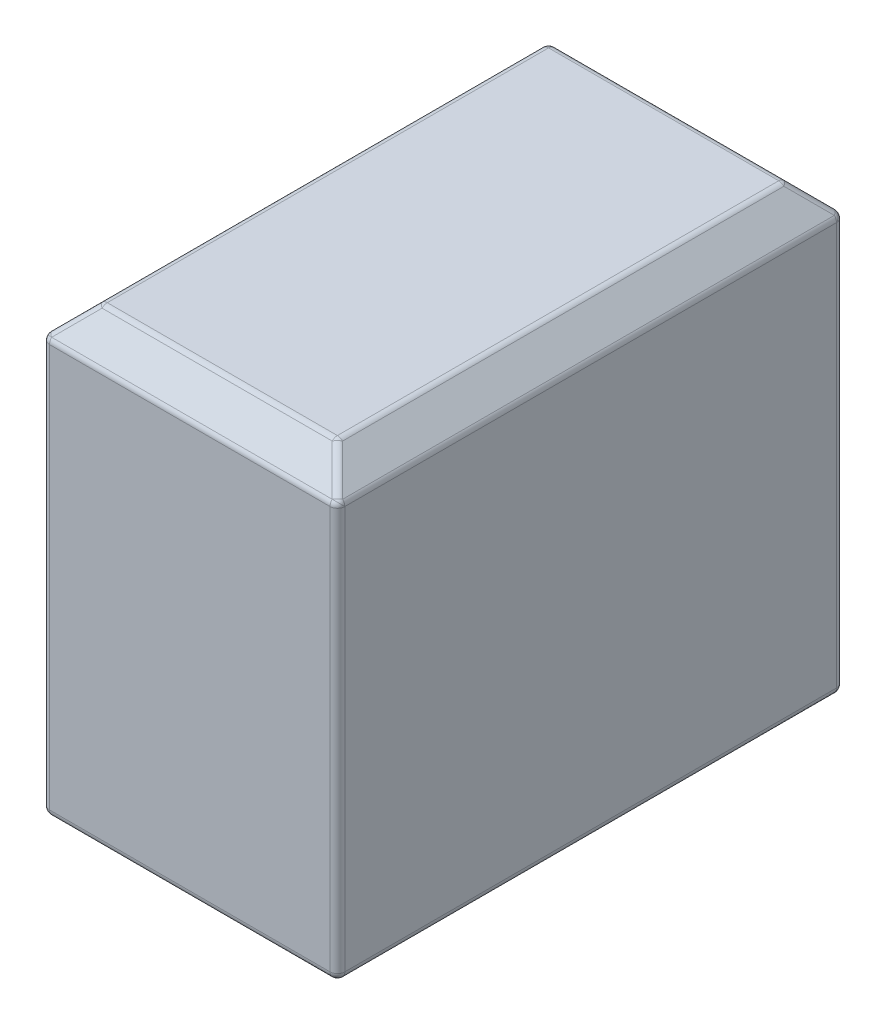
ISO-10303-21;
HEADER;
FILE_DESCRIPTION(('STEP AP214'),'2;1');
FILE_NAME('part.step','',(''),(''),'','','');
FILE_SCHEMA(('AUTOMOTIVE_DESIGN { 1 0 10303 214 1 1 1 1 }'));
ENDSEC;
DATA;
#1=APPLICATION_CONTEXT('core data for automotive mechanical design processes');
#2=APPLICATION_PROTOCOL_DEFINITION('international standard','automotive_design',2000,#1);
#3=PRODUCT_CONTEXT('',#1,'mechanical');
#4=PRODUCT('Part','Part','',(#3));
#5=PRODUCT_RELATED_PRODUCT_CATEGORY('part','',(#4));
#6=PRODUCT_DEFINITION_FORMATION('','',#4);
#7=PRODUCT_DEFINITION_CONTEXT('part definition',#1,'design');
#8=PRODUCT_DEFINITION('design','',#6,#7);
#9=PRODUCT_DEFINITION_SHAPE('','',#8);
#10=(LENGTH_UNIT() NAMED_UNIT(*) SI_UNIT(.MILLI.,.METRE.));
#11=(NAMED_UNIT(*) PLANE_ANGLE_UNIT() SI_UNIT($,.RADIAN.));
#12=(NAMED_UNIT(*) SI_UNIT($,.STERADIAN.) SOLID_ANGLE_UNIT());
#13=UNCERTAINTY_MEASURE_WITH_UNIT(LENGTH_MEASURE(1.E-05),#10,'distance_accuracy_value','');
#14=(GEOMETRIC_REPRESENTATION_CONTEXT(3) GLOBAL_UNCERTAINTY_ASSIGNED_CONTEXT((#13)) GLOBAL_UNIT_ASSIGNED_CONTEXT((#10,
#11,#12)) REPRESENTATION_CONTEXT('',''));
#15=CARTESIAN_POINT('',(0.,0.,0.));
#16=DIRECTION('',(0.,0.,1.));
#17=DIRECTION('',(1.,0.,0.));
#18=AXIS2_PLACEMENT_3D('',#15,#16,#17);
#19=CARTESIAN_POINT('',(1.,1.5,-1.715));
#20=DIRECTION('',(-1.,0.,0.));
#21=DIRECTION('',(0.,0.,1.));
#22=AXIS2_PLACEMENT_3D('',#19,#20,#21);
#23=PLANE('',#22);
#24=DIRECTION('',(0.,-1.,0.));
#25=VECTOR('',#24,1.);
#26=CARTESIAN_POINT('',(1.,1.5,1.665));
#27=LINE('',#26,#25);
#28=CARTESIAN_POINT('',(1.,1.27928932188134,1.665));
#29=VERTEX_POINT('',#28);
#30=CARTESIAN_POINT('',(1.,-1.45,1.665));
#31=VERTEX_POINT('',#30);
#32=EDGE_CURVE('E236',#29,#31,#27,.T.);
#33=ORIENTED_EDGE('',*,*,#32,.T.);
#34=DIRECTION('',(0.,0.,-1.));
#35=VECTOR('',#34,1.);
#36=CARTESIAN_POINT('',(1.,-1.45,-1.715));
#37=LINE('',#36,#35);
#38=CARTESIAN_POINT('',(1.,-1.45,-1.665));
#39=VERTEX_POINT('',#38);
#40=EDGE_CURVE('E239',#31,#39,#37,.T.);
#41=ORIENTED_EDGE('',*,*,#40,.T.);
#42=DIRECTION('',(0.,-1.,0.));
#43=VECTOR('',#42,1.);
#44=CARTESIAN_POINT('',(1.,1.5,-1.665));
#45=LINE('',#44,#43);
#46=CARTESIAN_POINT('',(1.,1.27928932188134,-1.665));
#47=VERTEX_POINT('',#46);
#48=EDGE_CURVE('E230',#39,#47,#45,.F.);
#49=ORIENTED_EDGE('',*,*,#48,.T.);
#50=DIRECTION('',(0.,0.,1.));
#51=VECTOR('',#50,1.);
#52=CARTESIAN_POINT('',(1.,1.27928932188134,1.715));
#53=LINE('',#52,#51);
#54=EDGE_CURVE('E233',#47,#29,#53,.T.);
#55=ORIENTED_EDGE('',*,*,#54,.T.);
#56=EDGE_LOOP('',(#33,#41,#49,#55));
#57=FACE_BOUND('',#56,.T.);
#58=ADVANCED_FACE('F39',(#57),#23,.F.);
#59=CARTESIAN_POINT('',(-1.,1.5,-1.715));
#60=DIRECTION('',(0.,0.,1.));
#61=DIRECTION('',(1.,0.,0.));
#62=AXIS2_PLACEMENT_3D('',#59,#60,#61);
#63=PLANE('',#62);
#64=DIRECTION('',(0.,-1.,0.));
#65=VECTOR('',#64,1.);
#66=CARTESIAN_POINT('',(0.95,1.5,-1.715));
#67=LINE('',#66,#65);
#68=CARTESIAN_POINT('',(0.95,1.27928932188134,-1.715));
#69=VERTEX_POINT('',#68);
#70=CARTESIAN_POINT('',(0.95,-1.45,-1.715));
#71=VERTEX_POINT('',#70);
#72=EDGE_CURVE('E250',#69,#71,#67,.T.);
#73=ORIENTED_EDGE('',*,*,#72,.T.);
#74=DIRECTION('',(-1.,0.,0.));
#75=VECTOR('',#74,1.);
#76=CARTESIAN_POINT('',(-1.,-1.45,-1.715));
#77=LINE('',#76,#75);
#78=CARTESIAN_POINT('',(-0.95,-1.45,-1.715));
#79=VERTEX_POINT('',#78);
#80=EDGE_CURVE('E284',#71,#79,#77,.T.);
#81=ORIENTED_EDGE('',*,*,#80,.T.);
#82=DIRECTION('',(0.,-1.,0.));
#83=VECTOR('',#82,1.);
#84=CARTESIAN_POINT('',(-0.95,1.5,-1.715));
#85=LINE('',#84,#83);
#86=CARTESIAN_POINT('',(-0.95,1.27928932188134,-1.715));
#87=VERTEX_POINT('',#86);
#88=EDGE_CURVE('E218',#79,#87,#85,.F.);
#89=ORIENTED_EDGE('',*,*,#88,.T.);
#90=DIRECTION('',(1.,0.,0.));
#91=VECTOR('',#90,1.);
#92=CARTESIAN_POINT('',(0.95,1.27928932188134,-1.715));
#93=LINE('',#92,#91);
#94=EDGE_CURVE('E282',#87,#69,#93,.T.);
#95=ORIENTED_EDGE('',*,*,#94,.T.);
#96=EDGE_LOOP('',(#73,#81,#89,#95));
#97=FACE_BOUND('',#96,.T.);
#98=ADVANCED_FACE('F500',(#97),#63,.F.);
#99=CARTESIAN_POINT('',(-1.,1.5,-1.715));
#100=DIRECTION('',(1.,0.,0.));
#101=DIRECTION('',(0.,0.,-1.));
#102=AXIS2_PLACEMENT_3D('',#99,#100,#101);
#103=PLANE('',#102);
#104=DIRECTION('',(0.,-1.,0.));
#105=VECTOR('',#104,1.);
#106=CARTESIAN_POINT('',(-1.,1.5,-1.665));
#107=LINE('',#106,#105);
#108=CARTESIAN_POINT('',(-1.,1.27928932188134,-1.665));
#109=VERTEX_POINT('',#108);
#110=CARTESIAN_POINT('',(-1.,-1.45,-1.665));
#111=VERTEX_POINT('',#110);
#112=EDGE_CURVE('E216',#109,#111,#107,.T.);
#113=ORIENTED_EDGE('',*,*,#112,.T.);
#114=DIRECTION('',(0.,0.,1.));
#115=VECTOR('',#114,1.);
#116=CARTESIAN_POINT('',(-1.,-1.45,-1.715));
#117=LINE('',#116,#115);
#118=CARTESIAN_POINT('',(-1.,-1.45,1.665));
#119=VERTEX_POINT('',#118);
#120=EDGE_CURVE('E197',#111,#119,#117,.T.);
#121=ORIENTED_EDGE('',*,*,#120,.T.);
#122=DIRECTION('',(0.,-1.,0.));
#123=VECTOR('',#122,1.);
#124=CARTESIAN_POINT('',(-1.,1.5,1.665));
#125=LINE('',#124,#123);
#126=CARTESIAN_POINT('',(-1.,1.27928932188134,1.665));
#127=VERTEX_POINT('',#126);
#128=EDGE_CURVE('E204',#119,#127,#125,.F.);
#129=ORIENTED_EDGE('',*,*,#128,.T.);
#130=DIRECTION('',(0.,0.,-1.));
#131=VECTOR('',#130,1.);
#132=CARTESIAN_POINT('',(-1.,1.27928932188134,-1.715));
#133=LINE('',#132,#131);
#134=EDGE_CURVE('E210',#127,#109,#133,.T.);
#135=ORIENTED_EDGE('',*,*,#134,.T.);
#136=EDGE_LOOP('',(#113,#121,#129,#135));
#137=FACE_BOUND('',#136,.T.);
#138=ADVANCED_FACE('F214',(#137),#103,.F.);
#139=CARTESIAN_POINT('',(-1.,1.5,1.715));
#140=DIRECTION('',(0.,0.,-1.));
#141=DIRECTION('',(-1.,0.,0.));
#142=AXIS2_PLACEMENT_3D('',#139,#140,#141);
#143=PLANE('',#142);
#144=DIRECTION('',(0.,-1.,0.));
#145=VECTOR('',#144,1.);
#146=CARTESIAN_POINT('',(0.95,1.5,1.715));
#147=LINE('',#146,#145);
#148=CARTESIAN_POINT('',(0.95,-1.45,1.715));
#149=VERTEX_POINT('',#148);
#150=CARTESIAN_POINT('',(0.95,1.27928932188134,1.715));
#151=VERTEX_POINT('',#150);
#152=EDGE_CURVE('E245',#149,#151,#147,.F.);
#153=ORIENTED_EDGE('',*,*,#152,.T.);
#154=DIRECTION('',(-1.,0.,0.));
#155=VECTOR('',#154,1.);
#156=CARTESIAN_POINT('',(-0.95,1.27928932188134,1.715));
#157=LINE('',#156,#155);
#158=CARTESIAN_POINT('',(-0.95,1.27928932188134,1.715));
#159=VERTEX_POINT('',#158);
#160=EDGE_CURVE('E334',#151,#159,#157,.T.);
#161=ORIENTED_EDGE('',*,*,#160,.T.);
#162=DIRECTION('',(0.,-1.,0.));
#163=VECTOR('',#162,1.);
#164=CARTESIAN_POINT('',(-0.95,1.5,1.715));
#165=LINE('',#164,#163);
#166=CARTESIAN_POINT('',(-0.95,-1.45,1.715));
#167=VERTEX_POINT('',#166);
#168=EDGE_CURVE('E228',#159,#167,#165,.T.);
#169=ORIENTED_EDGE('',*,*,#168,.T.);
#170=DIRECTION('',(1.,0.,0.));
#171=VECTOR('',#170,1.);
#172=CARTESIAN_POINT('',(-1.,-1.45,1.715));
#173=LINE('',#172,#171);
#174=EDGE_CURVE('E332',#167,#149,#173,.T.);
#175=ORIENTED_EDGE('',*,*,#174,.T.);
#176=EDGE_LOOP('',(#153,#161,#169,#175));
#177=FACE_BOUND('',#176,.T.);
#178=ADVANCED_FACE('F807',(#177),#143,.F.);
#179=CARTESIAN_POINT('',(0.,1.5,0.));
#180=DIRECTION('',(0.,1.,0.));
#181=DIRECTION('',(0.,0.,1.));
#182=AXIS2_PLACEMENT_3D('',#179,#180,#181);
#183=PLANE('',#182);
#184=DIRECTION('',(-1.,0.,0.));
#185=VECTOR('',#184,1.);
#186=CARTESIAN_POINT('',(0.,1.5,-1.49428932188135));
#187=LINE('',#186,#185);
#188=CARTESIAN_POINT('',(0.779289321881345,1.5,-1.49428932188135));
#189=VERTEX_POINT('',#188);
#190=CARTESIAN_POINT('',(-0.779289321881345,1.5,-1.49428932188135));
#191=VERTEX_POINT('',#190);
#192=EDGE_CURVE('E365',#189,#191,#187,.T.);
#193=ORIENTED_EDGE('',*,*,#192,.T.);
#194=DIRECTION('',(0.,0.,1.));
#195=VECTOR('',#194,1.);
#196=CARTESIAN_POINT('',(-0.779289321881345,1.5,0.));
#197=LINE('',#196,#195);
#198=CARTESIAN_POINT('',(-0.779289321881345,1.5,1.49428932188135));
#199=VERTEX_POINT('',#198);
#200=EDGE_CURVE('E367',#191,#199,#197,.T.);
#201=ORIENTED_EDGE('',*,*,#200,.T.);
#202=DIRECTION('',(1.,0.,0.));
#203=VECTOR('',#202,1.);
#204=CARTESIAN_POINT('',(0.,1.5,1.49428932188135));
#205=LINE('',#204,#203);
#206=CARTESIAN_POINT('',(0.779289321881345,1.5,1.49428932188135));
#207=VERTEX_POINT('',#206);
#208=EDGE_CURVE('E361',#199,#207,#205,.T.);
#209=ORIENTED_EDGE('',*,*,#208,.T.);
#210=DIRECTION('',(0.,0.,-1.));
#211=VECTOR('',#210,1.);
#212=CARTESIAN_POINT('',(0.779289321881345,1.5,0.));
#213=LINE('',#212,#211);
#214=EDGE_CURVE('E363',#207,#189,#213,.T.);
#215=ORIENTED_EDGE('',*,*,#214,.T.);
#216=EDGE_LOOP('',(#193,#201,#209,#215));
#217=FACE_BOUND('',#216,.T.);
#218=ADVANCED_FACE('F482',(#217),#183,.T.);
#219=CARTESIAN_POINT('',(0.,-1.5,0.));
#220=DIRECTION('',(0.,1.,0.));
#221=DIRECTION('',(0.,0.,1.));
#222=AXIS2_PLACEMENT_3D('',#219,#220,#221);
#223=PLANE('',#222);
#224=DIRECTION('',(0.,0.,-1.));
#225=VECTOR('',#224,1.);
#226=CARTESIAN_POINT('',(0.95,-1.5,0.));
#227=LINE('',#226,#225);
#228=CARTESIAN_POINT('',(0.95,-1.5,-1.665));
#229=VERTEX_POINT('',#228);
#230=CARTESIAN_POINT('',(0.95,-1.5,1.665));
#231=VERTEX_POINT('',#230);
#232=EDGE_CURVE('E242',#229,#231,#227,.F.);
#233=ORIENTED_EDGE('',*,*,#232,.T.);
#234=DIRECTION('',(1.,0.,0.));
#235=VECTOR('',#234,1.);
#236=CARTESIAN_POINT('',(0.,-1.5,1.665));
#237=LINE('',#236,#235);
#238=CARTESIAN_POINT('',(-0.95,-1.5,1.665));
#239=VERTEX_POINT('',#238);
#240=EDGE_CURVE('E336',#231,#239,#237,.F.);
#241=ORIENTED_EDGE('',*,*,#240,.T.);
#242=DIRECTION('',(0.,0.,1.));
#243=VECTOR('',#242,1.);
#244=CARTESIAN_POINT('',(-0.95,-1.5,0.));
#245=LINE('',#244,#243);
#246=CARTESIAN_POINT('',(-0.95,-1.5,-1.665));
#247=VERTEX_POINT('',#246);
#248=EDGE_CURVE('E199',#239,#247,#245,.F.);
#249=ORIENTED_EDGE('',*,*,#248,.T.);
#250=DIRECTION('',(-1.,0.,0.));
#251=VECTOR('',#250,1.);
#252=CARTESIAN_POINT('',(0.,-1.5,-1.665));
#253=LINE('',#252,#251);
#254=EDGE_CURVE('E286',#247,#229,#253,.F.);
#255=ORIENTED_EDGE('',*,*,#254,.T.);
#256=EDGE_LOOP('',(#233,#241,#249,#255));
#257=FACE_BOUND('',#256,.T.);
#258=ADVANCED_FACE('F520',(#257),#223,.F.);
#259=CARTESIAN_POINT('',(0.,1.5,-1.515));
#260=DIRECTION('',(0.,0.707106781186547,-0.707106781186548));
#261=DIRECTION('',(1.,0.,0.));
#262=AXIS2_PLACEMENT_3D('',#259,#260,#261);
#263=PLANE('',#262);
#264=DIRECTION('',(-0.577350269189626,-0.577350269189627,-0.577350269189625));
#265=VECTOR('',#264,1.);
#266=CARTESIAN_POINT('',(-0.509763107293782,1.75488155364689,-1.26011844635311));
#267=LINE('',#266,#265);
#268=CARTESIAN_POINT('',(-0.95,1.31464466094067,-1.70035533905933));
#269=VERTEX_POINT('',#268);
#270=CARTESIAN_POINT('',(-0.779289321881345,1.48535533905933,-1.52964466094067));
#271=VERTEX_POINT('',#270);
#272=EDGE_CURVE('E261',#269,#271,#267,.F.);
#273=ORIENTED_EDGE('',*,*,#272,.T.);
#274=DIRECTION('',(-1.,0.,0.));
#275=VECTOR('',#274,1.);
#276=CARTESIAN_POINT('',(0.,1.48535533905933,-1.52964466094067));
#277=LINE('',#276,#275);
#278=CARTESIAN_POINT('',(0.779289321881345,1.48535533905933,-1.52964466094067));
#279=VERTEX_POINT('',#278);
#280=EDGE_CURVE('E374',#271,#279,#277,.F.);
#281=ORIENTED_EDGE('',*,*,#280,.T.);
#282=DIRECTION('',(-0.577350269189625,0.577350269189627,0.577350269189625));
#283=VECTOR('',#282,1.);
#284=CARTESIAN_POINT('',(0.509763107293782,1.75488155364689,-1.26011844635311));
#285=LINE('',#284,#283);
#286=CARTESIAN_POINT('',(0.95,1.31464466094067,-1.70035533905933));
#287=VERTEX_POINT('',#286);
#288=EDGE_CURVE('E259',#279,#287,#285,.F.);
#289=ORIENTED_EDGE('',*,*,#288,.T.);
#290=DIRECTION('',(1.,0.,0.));
#291=VECTOR('',#290,1.);
#292=CARTESIAN_POINT('',(-0.95,1.31464466094067,-1.70035533905933));
#293=LINE('',#292,#291);
#294=EDGE_CURVE('E257',#287,#269,#293,.F.);
#295=ORIENTED_EDGE('',*,*,#294,.T.);
#296=EDGE_LOOP('',(#273,#281,#289,#295));
#297=FACE_BOUND('',#296,.T.);
#298=ADVANCED_FACE('F435',(#297),#263,.T.);
#299=CARTESIAN_POINT('',(-0.8,1.5,0.));
#300=DIRECTION('',(-0.707106781186548,0.707106781186547,0.));
#301=DIRECTION('',(0.,0.,-1.));
#302=AXIS2_PLACEMENT_3D('',#299,#300,#301);
#303=PLANE('',#302);
#304=DIRECTION('',(-0.577350269189625,-0.577350269189627,0.577350269189625));
#305=VECTOR('',#304,1.);
#306=CARTESIAN_POINT('',(-0.306785113019776,1.99321488698022,0.986429773960449));
#307=LINE('',#306,#305);
#308=CARTESIAN_POINT('',(-0.985355339059327,1.31464466094067,1.665));
#309=VERTEX_POINT('',#308);
#310=CARTESIAN_POINT('',(-0.814644660940672,1.48535533905933,1.49428932188135));
#311=VERTEX_POINT('',#310);
#312=EDGE_CURVE('E323',#309,#311,#307,.F.);
#313=ORIENTED_EDGE('',*,*,#312,.T.);
#314=DIRECTION('',(0.,0.,1.));
#315=VECTOR('',#314,1.);
#316=CARTESIAN_POINT('',(-0.814644660940672,1.48535533905933,0.));
#317=LINE('',#316,#315);
#318=CARTESIAN_POINT('',(-0.814644660940673,1.48535533905933,-1.49428932188135));
#319=VERTEX_POINT('',#318);
#320=EDGE_CURVE('E370',#311,#319,#317,.F.);
#321=ORIENTED_EDGE('',*,*,#320,.T.);
#322=DIRECTION('',(-0.577350269189625,-0.577350269189627,-0.577350269189625));
#323=VECTOR('',#322,1.);
#324=CARTESIAN_POINT('',(-0.306785113019776,1.99321488698022,-0.986429773960449));
#325=LINE('',#324,#323);
#326=CARTESIAN_POINT('',(-0.985355339059327,1.31464466094067,-1.665));
#327=VERTEX_POINT('',#326);
#328=EDGE_CURVE('E253',#319,#327,#325,.T.);
#329=ORIENTED_EDGE('',*,*,#328,.T.);
#330=DIRECTION('',(0.,0.,-1.));
#331=VECTOR('',#330,1.);
#332=CARTESIAN_POINT('',(-0.985355339059327,1.31464466094067,1.715));
#333=LINE('',#332,#331);
#334=EDGE_CURVE('E225',#327,#309,#333,.F.);
#335=ORIENTED_EDGE('',*,*,#334,.T.);
#336=EDGE_LOOP('',(#313,#321,#329,#335));
#337=FACE_BOUND('',#336,.T.);
#338=ADVANCED_FACE('F451',(#337),#303,.T.);
#339=CARTESIAN_POINT('',(0.8,1.5,0.));
#340=DIRECTION('',(0.707106781186548,0.707106781186547,0.));
#341=DIRECTION('',(0.,0.,1.));
#342=AXIS2_PLACEMENT_3D('',#339,#340,#341);
#343=PLANE('',#342);
#344=DIRECTION('',(-0.577350269189625,0.577350269189627,0.577350269189625));
#345=VECTOR('',#344,1.);
#346=CARTESIAN_POINT('',(0.306785113019777,1.99321488698022,-0.986429773960449));
#347=LINE('',#346,#345);
#348=CARTESIAN_POINT('',(0.985355339059327,1.31464466094067,-1.665));
#349=VERTEX_POINT('',#348);
#350=CARTESIAN_POINT('',(0.814644660940673,1.48535533905933,-1.49428932188135));
#351=VERTEX_POINT('',#350);
#352=EDGE_CURVE('E264',#349,#351,#347,.T.);
#353=ORIENTED_EDGE('',*,*,#352,.T.);
#354=DIRECTION('',(0.,0.,-1.));
#355=VECTOR('',#354,1.);
#356=CARTESIAN_POINT('',(0.814644660940673,1.48535533905933,0.));
#357=LINE('',#356,#355);
#358=CARTESIAN_POINT('',(0.814644660940673,1.48535533905933,1.49428932188135));
#359=VERTEX_POINT('',#358);
#360=EDGE_CURVE('E63',#351,#359,#357,.F.);
#361=ORIENTED_EDGE('',*,*,#360,.T.);
#362=DIRECTION('',(-0.577350269189625,0.577350269189627,-0.577350269189625));
#363=VECTOR('',#362,1.);
#364=CARTESIAN_POINT('',(0.306785113019777,1.99321488698022,0.986429773960449));
#365=LINE('',#364,#363);
#366=CARTESIAN_POINT('',(0.985355339059327,1.31464466094067,1.665));
#367=VERTEX_POINT('',#366);
#368=EDGE_CURVE('E318',#359,#367,#365,.F.);
#369=ORIENTED_EDGE('',*,*,#368,.T.);
#370=DIRECTION('',(0.,0.,1.));
#371=VECTOR('',#370,1.);
#372=CARTESIAN_POINT('',(0.985355339059327,1.31464466094067,-1.715));
#373=LINE('',#372,#371);
#374=EDGE_CURVE('E248',#367,#349,#373,.F.);
#375=ORIENTED_EDGE('',*,*,#374,.T.);
#376=EDGE_LOOP('',(#353,#361,#369,#375));
#377=FACE_BOUND('',#376,.T.);
#378=ADVANCED_FACE('F414',(#377),#343,.T.);
#379=CARTESIAN_POINT('',(0.,1.5,1.515));
#380=DIRECTION('',(0.,0.707106781186547,0.707106781186548));
#381=DIRECTION('',(-1.,0.,0.));
#382=AXIS2_PLACEMENT_3D('',#379,#380,#381);
#383=PLANE('',#382);
#384=DIRECTION('',(-0.577350269189625,0.577350269189627,-0.577350269189625));
#385=VECTOR('',#384,1.);
#386=CARTESIAN_POINT('',(0.509763107293782,1.75488155364689,1.26011844635311));
#387=LINE('',#386,#385);
#388=CARTESIAN_POINT('',(0.95,1.31464466094067,1.70035533905933));
#389=VERTEX_POINT('',#388);
#390=CARTESIAN_POINT('',(0.779289321881345,1.48535533905933,1.52964466094067));
#391=VERTEX_POINT('',#390);
#392=EDGE_CURVE('E316',#389,#391,#387,.T.);
#393=ORIENTED_EDGE('',*,*,#392,.T.);
#394=DIRECTION('',(1.,0.,0.));
#395=VECTOR('',#394,1.);
#396=CARTESIAN_POINT('',(0.,1.48535533905933,1.52964466094067));
#397=LINE('',#396,#395);
#398=CARTESIAN_POINT('',(-0.779289321881344,1.48535533905933,1.52964466094067));
#399=VERTEX_POINT('',#398);
#400=EDGE_CURVE('E11',#391,#399,#397,.F.);
#401=ORIENTED_EDGE('',*,*,#400,.T.);
#402=DIRECTION('',(-0.577350269189625,-0.577350269189627,0.577350269189625));
#403=VECTOR('',#402,1.);
#404=CARTESIAN_POINT('',(-0.509763107293782,1.75488155364689,1.26011844635311));
#405=LINE('',#404,#403);
#406=CARTESIAN_POINT('',(-0.95,1.31464466094067,1.70035533905933));
#407=VERTEX_POINT('',#406);
#408=EDGE_CURVE('E314',#399,#407,#405,.T.);
#409=ORIENTED_EDGE('',*,*,#408,.T.);
#410=DIRECTION('',(-1.,0.,0.));
#411=VECTOR('',#410,1.);
#412=CARTESIAN_POINT('',(0.95,1.31464466094067,1.70035533905933));
#413=LINE('',#412,#411);
#414=EDGE_CURVE('E288',#407,#389,#413,.F.);
#415=ORIENTED_EDGE('',*,*,#414,.T.);
#416=EDGE_LOOP('',(#393,#401,#409,#415));
#417=FACE_BOUND('',#416,.T.);
#418=ADVANCED_FACE('F469',(#417),#383,.T.);
#419=CARTESIAN_POINT('',(-0.95,1.27928932188134,-1.715));
#420=DIRECTION('',(0.,0.,1.));
#421=DIRECTION('',(1.,0.,0.));
#422=AXIS2_PLACEMENT_3D('',#419,#420,#421);
#423=CYLINDRICAL_SURFACE('',#422,0.05);
#424=ORIENTED_EDGE('',*,*,#134,.F.);
#425=CARTESIAN_POINT('',(-0.95,1.27928932188134,1.665));
#426=DIRECTION('',(0.,0.,1.));
#427=DIRECTION('',(1.,0.,0.));
#428=AXIS2_PLACEMENT_3D('',#425,#426,#427);
#429=CIRCLE('',#428,0.05);
#430=EDGE_CURVE('E201',#127,#309,#429,.F.);
#431=ORIENTED_EDGE('',*,*,#430,.T.);
#432=ORIENTED_EDGE('',*,*,#334,.F.);
#433=CARTESIAN_POINT('',(-0.95,1.27928932188134,-1.665));
#434=DIRECTION('',(0.,0.,1.));
#435=DIRECTION('',(1.,0.,0.));
#436=AXIS2_PLACEMENT_3D('',#433,#434,#435);
#437=CIRCLE('',#436,0.05);
#438=EDGE_CURVE('E255',#327,#109,#437,.T.);
#439=ORIENTED_EDGE('',*,*,#438,.T.);
#440=EDGE_LOOP('',(#424,#431,#432,#439));
#441=FACE_BOUND('',#440,.T.);
#442=ADVANCED_FACE('F447',(#441),#423,.T.);
#443=CARTESIAN_POINT('',(-0.95,1.5,-1.665));
#444=DIRECTION('',(0.,-1.,0.));
#445=DIRECTION('',(0.,0.,-1.));
#446=AXIS2_PLACEMENT_3D('',#443,#444,#445);
#447=CYLINDRICAL_SURFACE('',#446,0.05);
#448=ORIENTED_EDGE('',*,*,#88,.F.);
#449=CARTESIAN_POINT('',(-0.95,-1.45,-1.665));
#450=DIRECTION('',(0.,-1.,0.));
#451=DIRECTION('',(0.,0.,-1.));
#452=AXIS2_PLACEMENT_3D('',#449,#450,#451);
#453=CIRCLE('',#452,0.05);
#454=EDGE_CURVE('E277',#79,#111,#453,.F.);
#455=ORIENTED_EDGE('',*,*,#454,.T.);
#456=ORIENTED_EDGE('',*,*,#112,.F.);
#457=CARTESIAN_POINT('',(-0.95,1.27928932188134,-1.665));
#458=DIRECTION('',(0.,-1.,0.));
#459=DIRECTION('',(0.,0.,-1.));
#460=AXIS2_PLACEMENT_3D('',#457,#458,#459);
#461=CIRCLE('',#460,0.05);
#462=EDGE_CURVE('E275',#109,#87,#461,.T.);
#463=ORIENTED_EDGE('',*,*,#462,.T.);
#464=EDGE_LOOP('',(#448,#455,#456,#463));
#465=FACE_BOUND('',#464,.T.);
#466=ADVANCED_FACE('F525',(#465),#447,.T.);
#467=CARTESIAN_POINT('',(-0.95,1.5,1.665));
#468=DIRECTION('',(0.,-1.,0.));
#469=DIRECTION('',(0.,0.,-1.));
#470=AXIS2_PLACEMENT_3D('',#467,#468,#469);
#471=CYLINDRICAL_SURFACE('',#470,0.05);
#472=ORIENTED_EDGE('',*,*,#168,.F.);
#473=CARTESIAN_POINT('',(-0.95,1.27928932188134,1.665));
#474=DIRECTION('',(0.,-1.,0.));
#475=DIRECTION('',(0.,0.,-1.));
#476=AXIS2_PLACEMENT_3D('',#473,#474,#475);
#477=CIRCLE('',#476,0.05);
#478=EDGE_CURVE('E188',#159,#127,#477,.T.);
#479=ORIENTED_EDGE('',*,*,#478,.T.);
#480=ORIENTED_EDGE('',*,*,#128,.F.);
#481=CARTESIAN_POINT('',(-0.95,-1.45,1.665));
#482=DIRECTION('',(0.,-1.,0.));
#483=DIRECTION('',(0.,0.,-1.));
#484=AXIS2_PLACEMENT_3D('',#481,#482,#483);
#485=CIRCLE('',#484,0.05);
#486=EDGE_CURVE('E178',#119,#167,#485,.F.);
#487=ORIENTED_EDGE('',*,*,#486,.T.);
#488=EDGE_LOOP('',(#472,#479,#480,#487));
#489=FACE_BOUND('',#488,.T.);
#490=ADVANCED_FACE('F205',(#489),#471,.T.);
#491=CARTESIAN_POINT('',(-0.95,-1.45,-1.715));
#492=DIRECTION('',(0.,0.,1.));
#493=DIRECTION('',(1.,0.,0.));
#494=AXIS2_PLACEMENT_3D('',#491,#492,#493);
#495=CYLINDRICAL_SURFACE('',#494,0.05);
#496=ORIENTED_EDGE('',*,*,#248,.F.);
#497=CARTESIAN_POINT('',(-0.95,-1.45,1.665));
#498=DIRECTION('',(0.,0.,1.));
#499=DIRECTION('',(1.,0.,0.));
#500=AXIS2_PLACEMENT_3D('',#497,#498,#499);
#501=CIRCLE('',#500,0.05);
#502=EDGE_CURVE('E181',#239,#119,#501,.F.);
#503=ORIENTED_EDGE('',*,*,#502,.T.);
#504=ORIENTED_EDGE('',*,*,#120,.F.);
#505=CARTESIAN_POINT('',(-0.95,-1.45,-1.665));
#506=DIRECTION('',(0.,0.,1.));
#507=DIRECTION('',(1.,0.,0.));
#508=AXIS2_PLACEMENT_3D('',#505,#506,#507);
#509=CIRCLE('',#508,0.05);
#510=EDGE_CURVE('E273',#111,#247,#509,.T.);
#511=ORIENTED_EDGE('',*,*,#510,.T.);
#512=EDGE_LOOP('',(#496,#503,#504,#511));
#513=FACE_BOUND('',#512,.T.);
#514=ADVANCED_FACE('F194',(#513),#495,.T.);
#515=CARTESIAN_POINT('',(0.95,1.27928932188134,-1.715));
#516=DIRECTION('',(0.,0.,-1.));
#517=DIRECTION('',(-1.,0.,0.));
#518=AXIS2_PLACEMENT_3D('',#515,#516,#517);
#519=CYLINDRICAL_SURFACE('',#518,0.05);
#520=ORIENTED_EDGE('',*,*,#374,.F.);
#521=CARTESIAN_POINT('',(0.95,1.27928932188134,1.665));
#522=DIRECTION('',(0.,0.,-1.));
#523=DIRECTION('',(-1.,0.,0.));
#524=AXIS2_PLACEMENT_3D('',#521,#522,#523);
#525=CIRCLE('',#524,0.05);
#526=EDGE_CURVE('E320',#367,#29,#525,.T.);
#527=ORIENTED_EDGE('',*,*,#526,.T.);
#528=ORIENTED_EDGE('',*,*,#54,.F.);
#529=CARTESIAN_POINT('',(0.95,1.27928932188134,-1.665));
#530=DIRECTION('',(0.,0.,-1.));
#531=DIRECTION('',(-1.,0.,0.));
#532=AXIS2_PLACEMENT_3D('',#529,#530,#531);
#533=CIRCLE('',#532,0.05);
#534=EDGE_CURVE('E279',#47,#349,#533,.F.);
#535=ORIENTED_EDGE('',*,*,#534,.T.);
#536=EDGE_LOOP('',(#520,#527,#528,#535));
#537=FACE_BOUND('',#536,.T.);
#538=ADVANCED_FACE('F420',(#537),#519,.T.);
#539=CARTESIAN_POINT('',(0.95,1.5,1.665));
#540=DIRECTION('',(0.,-1.,0.));
#541=DIRECTION('',(0.,0.,-1.));
#542=AXIS2_PLACEMENT_3D('',#539,#540,#541);
#543=CYLINDRICAL_SURFACE('',#542,0.05);
#544=ORIENTED_EDGE('',*,*,#32,.F.);
#545=CARTESIAN_POINT('',(0.95,1.27928932188134,1.665));
#546=DIRECTION('',(0.,-1.,0.));
#547=DIRECTION('',(0.,0.,-1.));
#548=AXIS2_PLACEMENT_3D('',#545,#546,#547);
#549=CIRCLE('',#548,0.05);
#550=EDGE_CURVE('E189',#29,#151,#549,.T.);
#551=ORIENTED_EDGE('',*,*,#550,.T.);
#552=ORIENTED_EDGE('',*,*,#152,.F.);
#553=CARTESIAN_POINT('',(0.95,-1.45,1.665));
#554=DIRECTION('',(0.,-1.,0.));
#555=DIRECTION('',(0.,0.,-1.));
#556=AXIS2_PLACEMENT_3D('',#553,#554,#555);
#557=CIRCLE('',#556,0.05);
#558=EDGE_CURVE('E326',#149,#31,#557,.F.);
#559=ORIENTED_EDGE('',*,*,#558,.T.);
#560=EDGE_LOOP('',(#544,#551,#552,#559));
#561=FACE_BOUND('',#560,.T.);
#562=ADVANCED_FACE('F538',(#561),#543,.T.);
#563=CARTESIAN_POINT('',(0.95,1.5,-1.665));
#564=DIRECTION('',(0.,-1.,0.));
#565=DIRECTION('',(0.,0.,-1.));
#566=AXIS2_PLACEMENT_3D('',#563,#564,#565);
#567=CYLINDRICAL_SURFACE('',#566,0.05);
#568=ORIENTED_EDGE('',*,*,#48,.F.);
#569=CARTESIAN_POINT('',(0.95,-1.45,-1.665));
#570=DIRECTION('',(0.,-1.,0.));
#571=DIRECTION('',(0.,0.,-1.));
#572=AXIS2_PLACEMENT_3D('',#569,#570,#571);
#573=CIRCLE('',#572,0.05);
#574=EDGE_CURVE('E271',#39,#71,#573,.F.);
#575=ORIENTED_EDGE('',*,*,#574,.T.);
#576=ORIENTED_EDGE('',*,*,#72,.F.);
#577=CARTESIAN_POINT('',(0.95,1.27928932188134,-1.665));
#578=DIRECTION('',(0.,-1.,0.));
#579=DIRECTION('',(0.,0.,-1.));
#580=AXIS2_PLACEMENT_3D('',#577,#578,#579);
#581=CIRCLE('',#580,0.05);
#582=EDGE_CURVE('E269',#69,#47,#581,.T.);
#583=ORIENTED_EDGE('',*,*,#582,.T.);
#584=EDGE_LOOP('',(#568,#575,#576,#583));
#585=FACE_BOUND('',#584,.T.);
#586=ADVANCED_FACE('F534',(#585),#567,.T.);
#587=CARTESIAN_POINT('',(0.95,-1.45,-1.715));
#588=DIRECTION('',(0.,0.,-1.));
#589=DIRECTION('',(-1.,0.,0.));
#590=AXIS2_PLACEMENT_3D('',#587,#588,#589);
#591=CYLINDRICAL_SURFACE('',#590,0.05);
#592=ORIENTED_EDGE('',*,*,#40,.F.);
#593=CARTESIAN_POINT('',(0.95,-1.45,1.665));
#594=DIRECTION('',(0.,0.,-1.));
#595=DIRECTION('',(-1.,0.,0.));
#596=AXIS2_PLACEMENT_3D('',#593,#594,#595);
#597=CIRCLE('',#596,0.05);
#598=EDGE_CURVE('E200',#31,#231,#597,.T.);
#599=ORIENTED_EDGE('',*,*,#598,.T.);
#600=ORIENTED_EDGE('',*,*,#232,.F.);
#601=CARTESIAN_POINT('',(0.95,-1.45,-1.665));
#602=DIRECTION('',(0.,0.,-1.));
#603=DIRECTION('',(-1.,0.,0.));
#604=AXIS2_PLACEMENT_3D('',#601,#602,#603);
#605=CIRCLE('',#604,0.05);
#606=EDGE_CURVE('E266',#229,#39,#605,.F.);
#607=ORIENTED_EDGE('',*,*,#606,.T.);
#608=EDGE_LOOP('',(#592,#599,#600,#607));
#609=FACE_BOUND('',#608,.T.);
#610=ADVANCED_FACE('F531',(#609),#591,.T.);
#611=CARTESIAN_POINT('',(0.271429773960449,1.9578595479209,-0.986429773960449));
#612=DIRECTION('',(-0.577350269189625,0.577350269189627,0.577350269189625));
#613=DIRECTION('',(0.,-0.707106781186547,0.707106781186548));
#614=AXIS2_PLACEMENT_3D('',#611,#612,#613);
#615=CYLINDRICAL_SURFACE('',#614,0.05);
#616=ORIENTED_EDGE('',*,*,#288,.F.);
#617=CARTESIAN_POINT('',(0.779289321881345,1.45,-1.49428932188135));
#618=DIRECTION('',(-0.577350269189625,0.577350269189627,0.577350269189625));
#619=DIRECTION('',(0.,-0.707106781186547,0.707106781186548));
#620=AXIS2_PLACEMENT_3D('',#617,#618,#619);
#621=CIRCLE('',#620,0.05);
#622=EDGE_CURVE('E376',#279,#351,#621,.F.);
#623=ORIENTED_EDGE('',*,*,#622,.T.);
#624=ORIENTED_EDGE('',*,*,#352,.F.);
#625=CARTESIAN_POINT('',(0.95,1.27928932188134,-1.665));
#626=DIRECTION('',(0.577350269189628,-0.577350269189625,-0.577350269189625));
#627=DIRECTION('',(-0.707106781186545,0.,-0.70710678118655));
#628=AXIS2_PLACEMENT_3D('',#625,#626,#627);
#629=CIRCLE('',#628,0.05);
#630=EDGE_CURVE('E211',#287,#349,#629,.T.);
#631=ORIENTED_EDGE('',*,*,#630,.F.);
#632=EDGE_LOOP('',(#616,#623,#624,#631));
#633=FACE_BOUND('',#632,.T.);
#634=ADVANCED_FACE('F412',(#633),#615,.T.);
#635=CARTESIAN_POINT('',(0.95,1.27928932188134,-1.665));
#636=DIRECTION('',(0.,0.707106781186547,-0.707106781186548));
#637=DIRECTION('',(0.,0.707106781186548,0.707106781186547));
#638=AXIS2_PLACEMENT_3D('',#635,#636,#637);
#639=SPHERICAL_SURFACE('',#638,0.05);
#640=ORIENTED_EDGE('',*,*,#630,.T.);
#641=ORIENTED_EDGE('',*,*,#534,.F.);
#642=CARTESIAN_POINT('',(0.95,1.27928932188134,-1.665));
#643=DIRECTION('',(0.,-0.707106781186548,-0.707106781186548));
#644=DIRECTION('',(0.,0.707106781186548,-0.707106781186548));
#645=AXIS2_PLACEMENT_3D('',#642,#643,#644);
#646=CIRCLE('',#645,0.05);
#647=EDGE_CURVE('E302',#287,#47,#646,.T.);
#648=ORIENTED_EDGE('',*,*,#647,.F.);
#649=EDGE_LOOP('',(#640,#641,#648));
#650=FACE_BOUND('',#649,.T.);
#651=ADVANCED_FACE('F423',(#650),#639,.T.);
#652=CARTESIAN_POINT('',(0.95,1.27928932188134,-1.665));
#653=DIRECTION('',(0.,0.707106781186547,-0.707106781186548));
#654=DIRECTION('',(0.,0.707106781186548,0.707106781186547));
#655=AXIS2_PLACEMENT_3D('',#652,#653,#654);
#656=SPHERICAL_SURFACE('',#655,0.05);
#657=ORIENTED_EDGE('',*,*,#647,.T.);
#658=ORIENTED_EDGE('',*,*,#582,.F.);
#659=CARTESIAN_POINT('',(0.95,1.27928932188134,-1.665));
#660=DIRECTION('',(-1.,0.,0.));
#661=DIRECTION('',(0.,0.,1.));
#662=AXIS2_PLACEMENT_3D('',#659,#660,#661);
#663=CIRCLE('',#662,0.05);
#664=EDGE_CURVE('E299',#287,#69,#663,.T.);
#665=ORIENTED_EDGE('',*,*,#664,.F.);
#666=EDGE_LOOP('',(#657,#658,#665));
#667=FACE_BOUND('',#666,.T.);
#668=ADVANCED_FACE('F427',(#667),#656,.T.);
#669=CARTESIAN_POINT('',(-1.,1.27928932188134,-1.665));
#670=DIRECTION('',(-1.,0.,0.));
#671=DIRECTION('',(0.,0.,1.));
#672=AXIS2_PLACEMENT_3D('',#669,#670,#671);
#673=CYLINDRICAL_SURFACE('',#672,0.05);
#674=ORIENTED_EDGE('',*,*,#664,.T.);
#675=ORIENTED_EDGE('',*,*,#94,.F.);
#676=CARTESIAN_POINT('',(-0.95,1.27928932188134,-1.665));
#677=DIRECTION('',(-1.,0.,0.));
#678=DIRECTION('',(0.,0.,1.));
#679=AXIS2_PLACEMENT_3D('',#676,#677,#678);
#680=CIRCLE('',#679,0.05);
#681=EDGE_CURVE('E296',#269,#87,#680,.T.);
#682=ORIENTED_EDGE('',*,*,#681,.F.);
#683=ORIENTED_EDGE('',*,*,#294,.F.);
#684=EDGE_LOOP('',(#674,#675,#682,#683));
#685=FACE_BOUND('',#684,.T.);
#686=ADVANCED_FACE('F432',(#685),#673,.T.);
#687=CARTESIAN_POINT('',(-0.95,1.27928932188134,-1.665));
#688=DIRECTION('',(0.,0.707106781186547,-0.707106781186548));
#689=DIRECTION('',(0.,0.707106781186548,0.707106781186547));
#690=AXIS2_PLACEMENT_3D('',#687,#688,#689);
#691=SPHERICAL_SURFACE('',#690,0.05);
#692=ORIENTED_EDGE('',*,*,#681,.T.);
#693=ORIENTED_EDGE('',*,*,#462,.F.);
#694=CARTESIAN_POINT('',(-0.95,1.27928932188134,-1.665));
#695=DIRECTION('',(0.,0.707106781186548,0.707106781186548));
#696=DIRECTION('',(0.,-0.707106781186548,0.707106781186548));
#697=AXIS2_PLACEMENT_3D('',#694,#695,#696);
#698=CIRCLE('',#697,0.05);
#699=EDGE_CURVE('E292',#269,#109,#698,.T.);
#700=ORIENTED_EDGE('',*,*,#699,.F.);
#701=EDGE_LOOP('',(#692,#693,#700));
#702=FACE_BOUND('',#701,.T.);
#703=ADVANCED_FACE('F550',(#702),#691,.T.);
#704=CARTESIAN_POINT('',(-0.95,1.27928932188134,-1.665));
#705=DIRECTION('',(0.,0.707106781186547,-0.707106781186548));
#706=DIRECTION('',(0.,0.707106781186548,0.707106781186547));
#707=AXIS2_PLACEMENT_3D('',#704,#705,#706);
#708=SPHERICAL_SURFACE('',#707,0.05);
#709=ORIENTED_EDGE('',*,*,#699,.T.);
#710=ORIENTED_EDGE('',*,*,#438,.F.);
#711=CARTESIAN_POINT('',(-0.95,1.27928932188134,-1.665));
#712=DIRECTION('',(0.577350269189622,0.577350269189628,0.577350269189628));
#713=DIRECTION('',(0.,-0.707106781186547,0.707106781186547));
#714=AXIS2_PLACEMENT_3D('',#711,#712,#713);
#715=CIRCLE('',#714,0.05);
#716=EDGE_CURVE('E289',#269,#327,#715,.T.);
#717=ORIENTED_EDGE('',*,*,#716,.F.);
#718=EDGE_LOOP('',(#709,#710,#717));
#719=FACE_BOUND('',#718,.T.);
#720=ADVANCED_FACE('F444',(#719),#708,.T.);
#721=CARTESIAN_POINT('',(-0.271429773960449,1.9578595479209,-0.986429773960449));
#722=DIRECTION('',(-0.577350269189625,-0.577350269189627,-0.577350269189625));
#723=DIRECTION('',(0.707106781186548,-0.707106781186547,0.));
#724=AXIS2_PLACEMENT_3D('',#721,#722,#723);
#725=CYLINDRICAL_SURFACE('',#724,0.05);
#726=ORIENTED_EDGE('',*,*,#328,.F.);
#727=CARTESIAN_POINT('',(-0.779289321881345,1.45,-1.49428932188135));
#728=DIRECTION('',(-0.577350269189625,-0.577350269189627,-0.577350269189625));
#729=DIRECTION('',(0.707106781186548,-0.707106781186547,0.));
#730=AXIS2_PLACEMENT_3D('',#727,#728,#729);
#731=CIRCLE('',#730,0.05);
#732=EDGE_CURVE('E372',#319,#271,#731,.T.);
#733=ORIENTED_EDGE('',*,*,#732,.T.);
#734=ORIENTED_EDGE('',*,*,#272,.F.);
#735=ORIENTED_EDGE('',*,*,#716,.T.);
#736=EDGE_LOOP('',(#726,#733,#734,#735));
#737=FACE_BOUND('',#736,.T.);
#738=ADVANCED_FACE('F440',(#737),#725,.T.);
#739=CARTESIAN_POINT('',(-0.95,-1.45,-1.665));
#740=DIRECTION('',(0.,0.,1.));
#741=DIRECTION('',(1.,0.,0.));
#742=AXIS2_PLACEMENT_3D('',#739,#740,#741);
#743=SPHERICAL_SURFACE('',#742,0.05);
#744=ORIENTED_EDGE('',*,*,#510,.F.);
#745=ORIENTED_EDGE('',*,*,#454,.F.);
#746=CARTESIAN_POINT('',(-0.95,-1.45,-1.665));
#747=DIRECTION('',(1.,0.,0.));
#748=DIRECTION('',(0.,0.,-1.));
#749=AXIS2_PLACEMENT_3D('',#746,#747,#748);
#750=CIRCLE('',#749,0.05);
#751=EDGE_CURVE('E293',#247,#79,#750,.T.);
#752=ORIENTED_EDGE('',*,*,#751,.F.);
#753=EDGE_LOOP('',(#744,#745,#752));
#754=FACE_BOUND('',#753,.T.);
#755=ADVANCED_FACE('F547',(#754),#743,.T.);
#756=CARTESIAN_POINT('',(-1.,-1.45,-1.665));
#757=DIRECTION('',(-1.,0.,0.));
#758=DIRECTION('',(0.,0.,1.));
#759=AXIS2_PLACEMENT_3D('',#756,#757,#758);
#760=CYLINDRICAL_SURFACE('',#759,0.05);
#761=ORIENTED_EDGE('',*,*,#751,.T.);
#762=ORIENTED_EDGE('',*,*,#80,.F.);
#763=CARTESIAN_POINT('',(0.95,-1.45,-1.665));
#764=DIRECTION('',(1.,0.,0.));
#765=DIRECTION('',(0.,0.,-1.));
#766=AXIS2_PLACEMENT_3D('',#763,#764,#765);
#767=CIRCLE('',#766,0.05);
#768=EDGE_CURVE('E307',#229,#71,#767,.T.);
#769=ORIENTED_EDGE('',*,*,#768,.F.);
#770=ORIENTED_EDGE('',*,*,#254,.F.);
#771=EDGE_LOOP('',(#761,#762,#769,#770));
#772=FACE_BOUND('',#771,.T.);
#773=ADVANCED_FACE('F564',(#772),#760,.T.);
#774=CARTESIAN_POINT('',(0.95,-1.45,-1.665));
#775=DIRECTION('',(0.,0.,1.));
#776=DIRECTION('',(1.,0.,0.));
#777=AXIS2_PLACEMENT_3D('',#774,#775,#776);
#778=SPHERICAL_SURFACE('',#777,0.05);
#779=ORIENTED_EDGE('',*,*,#768,.T.);
#780=ORIENTED_EDGE('',*,*,#574,.F.);
#781=ORIENTED_EDGE('',*,*,#606,.F.);
#782=EDGE_LOOP('',(#779,#780,#781));
#783=FACE_BOUND('',#782,.T.);
#784=ADVANCED_FACE('F562',(#783),#778,.T.);
#785=CARTESIAN_POINT('',(-0.509763107293782,1.71952621458756,1.22476310729378));
#786=DIRECTION('',(-0.577350269189625,-0.577350269189627,0.577350269189625));
#787=DIRECTION('',(0.,-0.707106781186547,-0.707106781186548));
#788=AXIS2_PLACEMENT_3D('',#785,#786,#787);
#789=CYLINDRICAL_SURFACE('',#788,0.05);
#790=ORIENTED_EDGE('',*,*,#408,.F.);
#791=CARTESIAN_POINT('',(-0.779289321881345,1.45,1.49428932188135));
#792=DIRECTION('',(-0.577350269189625,-0.577350269189627,0.577350269189625));
#793=DIRECTION('',(0.,-0.707106781186547,-0.707106781186548));
#794=AXIS2_PLACEMENT_3D('',#791,#792,#793);
#795=CIRCLE('',#794,0.05);
#796=EDGE_CURVE('E338',#399,#311,#795,.T.);
#797=ORIENTED_EDGE('',*,*,#796,.T.);
#798=ORIENTED_EDGE('',*,*,#312,.F.);
#799=CARTESIAN_POINT('',(-0.95,1.27928932188134,1.665));
#800=DIRECTION('',(-0.577350269189629,-0.577350269189624,0.577350269189624));
#801=DIRECTION('',(0.707106781186544,0.,0.707106781186551));
#802=AXIS2_PLACEMENT_3D('',#799,#800,#801);
#803=CIRCLE('',#802,0.05);
#804=EDGE_CURVE('E310',#407,#309,#803,.T.);
#805=ORIENTED_EDGE('',*,*,#804,.F.);
#806=EDGE_LOOP('',(#790,#797,#798,#805));
#807=FACE_BOUND('',#806,.T.);
#808=ADVANCED_FACE('F455',(#807),#789,.T.);
#809=CARTESIAN_POINT('',(-0.95,1.27928932188134,1.665));
#810=DIRECTION('',(0.,0.707106781186547,0.707106781186548));
#811=DIRECTION('',(0.,-0.707106781186548,0.707106781186547));
#812=AXIS2_PLACEMENT_3D('',#809,#810,#811);
#813=SPHERICAL_SURFACE('',#812,0.05);
#814=ORIENTED_EDGE('',*,*,#804,.T.);
#815=ORIENTED_EDGE('',*,*,#430,.F.);
#816=CARTESIAN_POINT('',(-0.95,1.27928932188135,1.665));
#817=DIRECTION('',(0.,-0.707106781186548,0.707106781186548));
#818=DIRECTION('',(0.,-0.707106781186548,-0.707106781186548));
#819=AXIS2_PLACEMENT_3D('',#816,#817,#818);
#820=CIRCLE('',#819,0.05);
#821=EDGE_CURVE('E351',#407,#127,#820,.T.);
#822=ORIENTED_EDGE('',*,*,#821,.F.);
#823=EDGE_LOOP('',(#814,#815,#822));
#824=FACE_BOUND('',#823,.T.);
#825=ADVANCED_FACE('F459',(#824),#813,.T.);
#826=CARTESIAN_POINT('',(-0.95,1.27928932188134,1.665));
#827=DIRECTION('',(0.,0.707106781186547,0.707106781186548));
#828=DIRECTION('',(0.,-0.707106781186548,0.707106781186547));
#829=AXIS2_PLACEMENT_3D('',#826,#827,#828);
#830=SPHERICAL_SURFACE('',#829,0.05);
#831=ORIENTED_EDGE('',*,*,#821,.T.);
#832=ORIENTED_EDGE('',*,*,#478,.F.);
#833=CARTESIAN_POINT('',(-0.95,1.27928932188134,1.665));
#834=DIRECTION('',(1.,0.,0.));
#835=DIRECTION('',(0.,0.,-1.));
#836=AXIS2_PLACEMENT_3D('',#833,#834,#835);
#837=CIRCLE('',#836,0.05);
#838=EDGE_CURVE('E348',#407,#159,#837,.T.);
#839=ORIENTED_EDGE('',*,*,#838,.F.);
#840=EDGE_LOOP('',(#831,#832,#839));
#841=FACE_BOUND('',#840,.T.);
#842=ADVANCED_FACE('F463',(#841),#830,.T.);
#843=CARTESIAN_POINT('',(-1.,1.27928932188134,1.665));
#844=DIRECTION('',(1.,0.,0.));
#845=DIRECTION('',(0.,0.,-1.));
#846=AXIS2_PLACEMENT_3D('',#843,#844,#845);
#847=CYLINDRICAL_SURFACE('',#846,0.05);
#848=ORIENTED_EDGE('',*,*,#838,.T.);
#849=ORIENTED_EDGE('',*,*,#160,.F.);
#850=CARTESIAN_POINT('',(0.95,1.27928932188134,1.665));
#851=DIRECTION('',(1.,0.,0.));
#852=DIRECTION('',(0.,0.,-1.));
#853=AXIS2_PLACEMENT_3D('',#850,#851,#852);
#854=CIRCLE('',#853,0.05);
#855=EDGE_CURVE('E345',#389,#151,#854,.T.);
#856=ORIENTED_EDGE('',*,*,#855,.F.);
#857=ORIENTED_EDGE('',*,*,#414,.F.);
#858=EDGE_LOOP('',(#848,#849,#856,#857));
#859=FACE_BOUND('',#858,.T.);
#860=ADVANCED_FACE('F467',(#859),#847,.T.);
#861=CARTESIAN_POINT('',(0.95,1.27928932188134,1.665));
#862=DIRECTION('',(0.,0.707106781186547,0.707106781186548));
#863=DIRECTION('',(0.,-0.707106781186548,0.707106781186547));
#864=AXIS2_PLACEMENT_3D('',#861,#862,#863);
#865=SPHERICAL_SURFACE('',#864,0.05);
#866=ORIENTED_EDGE('',*,*,#855,.T.);
#867=ORIENTED_EDGE('',*,*,#550,.F.);
#868=CARTESIAN_POINT('',(0.95,1.27928932188134,1.665));
#869=DIRECTION('',(0.,0.707106781186548,-0.707106781186548));
#870=DIRECTION('',(0.,0.707106781186548,0.707106781186548));
#871=AXIS2_PLACEMENT_3D('',#868,#869,#870);
#872=CIRCLE('',#871,0.05);
#873=EDGE_CURVE('E342',#389,#29,#872,.T.);
#874=ORIENTED_EDGE('',*,*,#873,.F.);
#875=EDGE_LOOP('',(#866,#867,#874));
#876=FACE_BOUND('',#875,.T.);
#877=ADVANCED_FACE('F580',(#876),#865,.T.);
#878=CARTESIAN_POINT('',(0.509763107293782,1.71952621458756,1.22476310729378));
#879=DIRECTION('',(-0.577350269189625,0.577350269189627,-0.577350269189625));
#880=DIRECTION('',(0.,0.707106781186547,0.707106781186548));
#881=AXIS2_PLACEMENT_3D('',#878,#879,#880);
#882=CYLINDRICAL_SURFACE('',#881,0.05);
#883=ORIENTED_EDGE('',*,*,#368,.F.);
#884=CARTESIAN_POINT('',(0.779289321881345,1.45,1.49428932188135));
#885=DIRECTION('',(-0.577350269189625,0.577350269189627,-0.577350269189625));
#886=DIRECTION('',(0.,0.707106781186547,0.707106781186548));
#887=AXIS2_PLACEMENT_3D('',#884,#885,#886);
#888=CIRCLE('',#887,0.05);
#889=EDGE_CURVE('E48',#359,#391,#888,.F.);
#890=ORIENTED_EDGE('',*,*,#889,.T.);
#891=ORIENTED_EDGE('',*,*,#392,.F.);
#892=CARTESIAN_POINT('',(0.950000000000001,1.27928932188134,1.665));
#893=DIRECTION('',(0.577350269189624,-0.577350269189624,0.577350269189629));
#894=DIRECTION('',(0.707106781186551,0.,-0.707106781186544));
#895=AXIS2_PLACEMENT_3D('',#892,#893,#894);
#896=CIRCLE('',#895,0.05);
#897=EDGE_CURVE('E339',#367,#389,#896,.T.);
#898=ORIENTED_EDGE('',*,*,#897,.F.);
#899=EDGE_LOOP('',(#883,#890,#891,#898));
#900=FACE_BOUND('',#899,.T.);
#901=ADVANCED_FACE('F576',(#900),#882,.T.);
#902=CARTESIAN_POINT('',(0.95,1.27928932188134,1.665));
#903=DIRECTION('',(0.,0.707106781186547,0.707106781186548));
#904=DIRECTION('',(0.,-0.707106781186548,0.707106781186547));
#905=AXIS2_PLACEMENT_3D('',#902,#903,#904);
#906=SPHERICAL_SURFACE('',#905,0.05);
#907=ORIENTED_EDGE('',*,*,#873,.T.);
#908=ORIENTED_EDGE('',*,*,#526,.F.);
#909=ORIENTED_EDGE('',*,*,#897,.T.);
#910=EDGE_LOOP('',(#907,#908,#909));
#911=FACE_BOUND('',#910,.T.);
#912=ADVANCED_FACE('F572',(#911),#906,.T.);
#913=CARTESIAN_POINT('',(0.95,-1.45,1.665));
#914=DIRECTION('',(0.,0.,1.));
#915=DIRECTION('',(1.,0.,0.));
#916=AXIS2_PLACEMENT_3D('',#913,#914,#915);
#917=SPHERICAL_SURFACE('',#916,0.05);
#918=ORIENTED_EDGE('',*,*,#598,.F.);
#919=ORIENTED_EDGE('',*,*,#558,.F.);
#920=CARTESIAN_POINT('',(0.95,-1.45,1.665));
#921=DIRECTION('',(-1.,0.,0.));
#922=DIRECTION('',(0.,0.,1.));
#923=AXIS2_PLACEMENT_3D('',#920,#921,#922);
#924=CIRCLE('',#923,0.05);
#925=EDGE_CURVE('E343',#231,#149,#924,.T.);
#926=ORIENTED_EDGE('',*,*,#925,.F.);
#927=EDGE_LOOP('',(#918,#919,#926));
#928=FACE_BOUND('',#927,.T.);
#929=ADVANCED_FACE('F575',(#928),#917,.T.);
#930=CARTESIAN_POINT('',(-1.,-1.45,1.665));
#931=DIRECTION('',(1.,0.,0.));
#932=DIRECTION('',(0.,0.,-1.));
#933=AXIS2_PLACEMENT_3D('',#930,#931,#932);
#934=CYLINDRICAL_SURFACE('',#933,0.05);
#935=ORIENTED_EDGE('',*,*,#925,.T.);
#936=ORIENTED_EDGE('',*,*,#174,.F.);
#937=CARTESIAN_POINT('',(-0.95,-1.45,1.665));
#938=DIRECTION('',(-1.,0.,0.));
#939=DIRECTION('',(0.,0.,1.));
#940=AXIS2_PLACEMENT_3D('',#937,#938,#939);
#941=CIRCLE('',#940,0.05);
#942=EDGE_CURVE('E183',#239,#167,#941,.T.);
#943=ORIENTED_EDGE('',*,*,#942,.F.);
#944=ORIENTED_EDGE('',*,*,#240,.F.);
#945=EDGE_LOOP('',(#935,#936,#943,#944));
#946=FACE_BOUND('',#945,.T.);
#947=ADVANCED_FACE('F594',(#946),#934,.T.);
#948=CARTESIAN_POINT('',(-0.95,-1.45,1.665));
#949=DIRECTION('',(0.,0.,1.));
#950=DIRECTION('',(1.,0.,0.));
#951=AXIS2_PLACEMENT_3D('',#948,#949,#950);
#952=SPHERICAL_SURFACE('',#951,0.05);
#953=ORIENTED_EDGE('',*,*,#942,.T.);
#954=ORIENTED_EDGE('',*,*,#486,.F.);
#955=ORIENTED_EDGE('',*,*,#502,.F.);
#956=EDGE_LOOP('',(#953,#954,#955));
#957=FACE_BOUND('',#956,.T.);
#958=ADVANCED_FACE('F180',(#957),#952,.T.);
#959=CARTESIAN_POINT('',(0.779289321881345,1.45,-1.49428932188135));
#960=DIRECTION('',(0.,1.,0.));
#961=DIRECTION('',(0.,0.,1.));
#962=AXIS2_PLACEMENT_3D('',#959,#960,#961);
#963=SPHERICAL_SURFACE('',#962,0.05);
#964=CARTESIAN_POINT('',(0.779289321881345,1.45,-1.49428932188135));
#965=DIRECTION('',(0.,0.,1.));
#966=DIRECTION('',(1.,0.,0.));
#967=AXIS2_PLACEMENT_3D('',#964,#965,#966);
#968=CIRCLE('',#967,0.05);
#969=EDGE_CURVE('E395',#351,#189,#968,.T.);
#970=ORIENTED_EDGE('',*,*,#969,.F.);
#971=ORIENTED_EDGE('',*,*,#622,.F.);
#972=CARTESIAN_POINT('',(0.779289321881345,1.45,-1.49428932188135));
#973=DIRECTION('',(-1.,0.,0.));
#974=DIRECTION('',(0.,0.,1.));
#975=AXIS2_PLACEMENT_3D('',#972,#973,#974);
#976=CIRCLE('',#975,0.05);
#977=EDGE_CURVE('E43',#189,#279,#976,.T.);
#978=ORIENTED_EDGE('',*,*,#977,.F.);
#979=EDGE_LOOP('',(#970,#971,#978));
#980=FACE_BOUND('',#979,.T.);
#981=ADVANCED_FACE('F41',(#980),#963,.T.);
#982=CARTESIAN_POINT('',(0.,1.45,-1.49428932188135));
#983=DIRECTION('',(-1.,0.,0.));
#984=DIRECTION('',(0.,0.,1.));
#985=AXIS2_PLACEMENT_3D('',#982,#983,#984);
#986=CYLINDRICAL_SURFACE('',#985,0.05);
#987=ORIENTED_EDGE('',*,*,#977,.T.);
#988=ORIENTED_EDGE('',*,*,#280,.F.);
#989=CARTESIAN_POINT('',(-0.779289321881345,1.45,-1.49428932188135));
#990=DIRECTION('',(-1.,0.,0.));
#991=DIRECTION('',(0.,0.,1.));
#992=AXIS2_PLACEMENT_3D('',#989,#990,#991);
#993=CIRCLE('',#992,0.05);
#994=EDGE_CURVE('E393',#191,#271,#993,.T.);
#995=ORIENTED_EDGE('',*,*,#994,.F.);
#996=ORIENTED_EDGE('',*,*,#192,.F.);
#997=EDGE_LOOP('',(#987,#988,#995,#996));
#998=FACE_BOUND('',#997,.T.);
#999=ADVANCED_FACE('F405',(#998),#986,.T.);
#1000=CARTESIAN_POINT('',(0.779289321881345,1.45,0.));
#1001=DIRECTION('',(0.,0.,-1.));
#1002=DIRECTION('',(-1.,0.,0.));
#1003=AXIS2_PLACEMENT_3D('',#1000,#1001,#1002);
#1004=CYLINDRICAL_SURFACE('',#1003,0.05);
#1005=ORIENTED_EDGE('',*,*,#969,.T.);
#1006=ORIENTED_EDGE('',*,*,#214,.F.);
#1007=CARTESIAN_POINT('',(0.779289321881345,1.45,1.49428932188134));
#1008=DIRECTION('',(0.,0.,1.));
#1009=DIRECTION('',(1.,0.,0.));
#1010=AXIS2_PLACEMENT_3D('',#1007,#1008,#1009);
#1011=CIRCLE('',#1010,0.05);
#1012=EDGE_CURVE('E390',#359,#207,#1011,.T.);
#1013=ORIENTED_EDGE('',*,*,#1012,.F.);
#1014=ORIENTED_EDGE('',*,*,#360,.F.);
#1015=EDGE_LOOP('',(#1005,#1006,#1013,#1014));
#1016=FACE_BOUND('',#1015,.T.);
#1017=ADVANCED_FACE('F490',(#1016),#1004,.T.);
#1018=CARTESIAN_POINT('',(-0.779289321881345,1.45,-1.49428932188135));
#1019=DIRECTION('',(0.,1.,0.));
#1020=DIRECTION('',(0.,0.,1.));
#1021=AXIS2_PLACEMENT_3D('',#1018,#1019,#1020);
#1022=SPHERICAL_SURFACE('',#1021,0.05);
#1023=ORIENTED_EDGE('',*,*,#994,.T.);
#1024=ORIENTED_EDGE('',*,*,#732,.F.);
#1025=CARTESIAN_POINT('',(-0.779289321881345,1.45,-1.49428932188135));
#1026=DIRECTION('',(0.,0.,1.));
#1027=DIRECTION('',(1.,0.,0.));
#1028=AXIS2_PLACEMENT_3D('',#1025,#1026,#1027);
#1029=CIRCLE('',#1028,0.05);
#1030=EDGE_CURVE('E387',#191,#319,#1029,.T.);
#1031=ORIENTED_EDGE('',*,*,#1030,.F.);
#1032=EDGE_LOOP('',(#1023,#1024,#1031));
#1033=FACE_BOUND('',#1032,.T.);
#1034=ADVANCED_FACE('F487',(#1033),#1022,.T.);
#1035=CARTESIAN_POINT('',(0.779289321881345,1.45,1.49428932188135));
#1036=DIRECTION('',(0.,1.,0.));
#1037=DIRECTION('',(0.,0.,1.));
#1038=AXIS2_PLACEMENT_3D('',#1035,#1036,#1037);
#1039=SPHERICAL_SURFACE('',#1038,0.05);
#1040=ORIENTED_EDGE('',*,*,#889,.F.);
#1041=ORIENTED_EDGE('',*,*,#1012,.T.);
#1042=CARTESIAN_POINT('',(0.779289321881345,1.45,1.49428932188135));
#1043=DIRECTION('',(-1.,0.,0.));
#1044=DIRECTION('',(0.,-1.,0.));
#1045=AXIS2_PLACEMENT_3D('',#1042,#1043,#1044);
#1046=CIRCLE('',#1045,0.05);
#1047=EDGE_CURVE('E384',#391,#207,#1046,.T.);
#1048=ORIENTED_EDGE('',*,*,#1047,.F.);
#1049=EDGE_LOOP('',(#1040,#1041,#1048));
#1050=FACE_BOUND('',#1049,.T.);
#1051=ADVANCED_FACE('F489',(#1050),#1039,.T.);
#1052=CARTESIAN_POINT('',(-0.779289321881345,1.45,0.));
#1053=DIRECTION('',(0.,0.,1.));
#1054=DIRECTION('',(1.,0.,0.));
#1055=AXIS2_PLACEMENT_3D('',#1052,#1053,#1054);
#1056=CYLINDRICAL_SURFACE('',#1055,0.05);
#1057=ORIENTED_EDGE('',*,*,#1030,.T.);
#1058=ORIENTED_EDGE('',*,*,#320,.F.);
#1059=CARTESIAN_POINT('',(-0.779289321881344,1.45,1.49428932188135));
#1060=DIRECTION('',(0.,0.,1.));
#1061=DIRECTION('',(1.,0.,0.));
#1062=AXIS2_PLACEMENT_3D('',#1059,#1060,#1061);
#1063=CIRCLE('',#1062,0.05);
#1064=EDGE_CURVE('E382',#199,#311,#1063,.T.);
#1065=ORIENTED_EDGE('',*,*,#1064,.F.);
#1066=ORIENTED_EDGE('',*,*,#200,.F.);
#1067=EDGE_LOOP('',(#1057,#1058,#1065,#1066));
#1068=FACE_BOUND('',#1067,.T.);
#1069=ADVANCED_FACE('F484',(#1068),#1056,.T.);
#1070=CARTESIAN_POINT('',(0.,1.45,1.49428932188135));
#1071=DIRECTION('',(1.,0.,0.));
#1072=DIRECTION('',(0.,0.,-1.));
#1073=AXIS2_PLACEMENT_3D('',#1070,#1071,#1072);
#1074=CYLINDRICAL_SURFACE('',#1073,0.05);
#1075=ORIENTED_EDGE('',*,*,#1047,.T.);
#1076=ORIENTED_EDGE('',*,*,#208,.F.);
#1077=CARTESIAN_POINT('',(-0.779289321881345,1.45,1.49428932188135));
#1078=DIRECTION('',(-1.,0.,0.));
#1079=DIRECTION('',(0.,0.,1.));
#1080=AXIS2_PLACEMENT_3D('',#1077,#1078,#1079);
#1081=CIRCLE('',#1080,0.05);
#1082=EDGE_CURVE('E380',#399,#199,#1081,.T.);
#1083=ORIENTED_EDGE('',*,*,#1082,.F.);
#1084=ORIENTED_EDGE('',*,*,#400,.F.);
#1085=EDGE_LOOP('',(#1075,#1076,#1083,#1084));
#1086=FACE_BOUND('',#1085,.T.);
#1087=ADVANCED_FACE('F479',(#1086),#1074,.T.);
#1088=CARTESIAN_POINT('',(-0.779289321881345,1.45,1.49428932188135));
#1089=DIRECTION('',(0.,1.,0.));
#1090=DIRECTION('',(0.,0.,1.));
#1091=AXIS2_PLACEMENT_3D('',#1088,#1089,#1090);
#1092=SPHERICAL_SURFACE('',#1091,0.05);
#1093=ORIENTED_EDGE('',*,*,#1064,.T.);
#1094=ORIENTED_EDGE('',*,*,#796,.F.);
#1095=ORIENTED_EDGE('',*,*,#1082,.T.);
#1096=EDGE_LOOP('',(#1093,#1094,#1095));
#1097=FACE_BOUND('',#1096,.T.);
#1098=ADVANCED_FACE('F474',(#1097),#1092,.T.);
#1099=CLOSED_SHELL('',(#58,#98,#138,#178,#218,#258,#298,#338,#378,#418,#442,#466,#490,#514,#538,
#562,#586,#610,#634,#651,#668,#686,#703,#720,#738,#755,#773,#784,#808,#825,#842,#860,#877,#901,
#912,#929,#947,#958,#981,#999,#1017,#1034,#1051,#1069,#1087,#1098));
#1100=MANIFOLD_SOLID_BREP('B2',#1099);
#1101=ADVANCED_BREP_SHAPE_REPRESENTATION('',(#18,#1100),#14);
#1102=SHAPE_DEFINITION_REPRESENTATION(#9,#1101);
ENDSEC;
END-ISO-10303-21;
